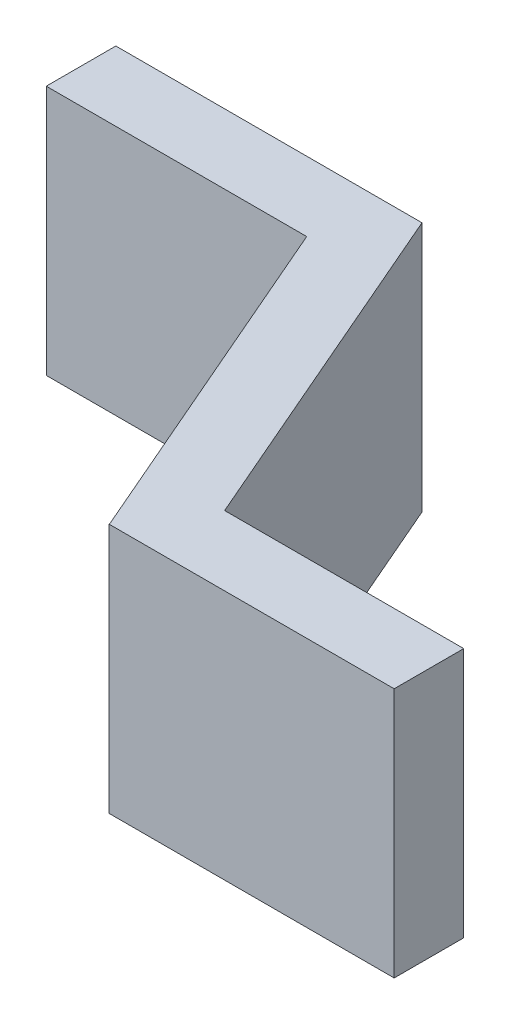
ISO-10303-21;
HEADER;
FILE_DESCRIPTION(('STEP AP214'),'2;1');
FILE_NAME('part.step','',(''),(''),'','','');
FILE_SCHEMA(('AUTOMOTIVE_DESIGN { 1 0 10303 214 1 1 1 1 }'));
ENDSEC;
DATA;
#1=APPLICATION_CONTEXT('core data for automotive mechanical design processes');
#2=APPLICATION_PROTOCOL_DEFINITION('international standard','automotive_design',2000,#1);
#3=PRODUCT_CONTEXT('',#1,'mechanical');
#4=PRODUCT('Part','Part','',(#3));
#5=PRODUCT_RELATED_PRODUCT_CATEGORY('part','',(#4));
#6=PRODUCT_DEFINITION_FORMATION('','',#4);
#7=PRODUCT_DEFINITION_CONTEXT('part definition',#1,'design');
#8=PRODUCT_DEFINITION('design','',#6,#7);
#9=PRODUCT_DEFINITION_SHAPE('','',#8);
#10=(LENGTH_UNIT() NAMED_UNIT(*) SI_UNIT(.MILLI.,.METRE.));
#11=(NAMED_UNIT(*) PLANE_ANGLE_UNIT() SI_UNIT($,.RADIAN.));
#12=(NAMED_UNIT(*) SI_UNIT($,.STERADIAN.) SOLID_ANGLE_UNIT());
#13=UNCERTAINTY_MEASURE_WITH_UNIT(LENGTH_MEASURE(1.E-05),#10,'distance_accuracy_value','');
#14=(GEOMETRIC_REPRESENTATION_CONTEXT(3) GLOBAL_UNCERTAINTY_ASSIGNED_CONTEXT((#13)) GLOBAL_UNIT_ASSIGNED_CONTEXT((#10,
#11,#12)) REPRESENTATION_CONTEXT('',''));
#15=CARTESIAN_POINT('',(0.,0.,0.));
#16=DIRECTION('',(0.,0.,1.));
#17=DIRECTION('',(1.,0.,0.));
#18=AXIS2_PLACEMENT_3D('',#15,#16,#17);
#19=CARTESIAN_POINT('',(0.,5.82,0.));
#20=DIRECTION('',(1.,0.,0.));
#21=DIRECTION('',(0.,0.,-1.));
#22=AXIS2_PLACEMENT_3D('',#19,#20,#21);
#23=PLANE('',#22);
#24=DIRECTION('',(0.,1.,0.));
#25=VECTOR('',#24,1.);
#26=CARTESIAN_POINT('',(0.,5.82,0.));
#27=LINE('',#26,#25);
#28=CARTESIAN_POINT('',(0.,6.180000014305,-1.30339419427667E-10));
#29=VERTEX_POINT('',#28);
#30=CARTESIAN_POINT('',(0.,5.82,-1.556831963824E-10));
#31=VERTEX_POINT('',#30);
#32=EDGE_CURVE('E123',#29,#31,#27,.F.);
#33=ORIENTED_EDGE('',*,*,#32,.T.);
#34=DIRECTION('',(0.,0.,1.));
#35=VECTOR('',#34,1.);
#36=CARTESIAN_POINT('',(0.,5.82,0.));
#37=LINE('',#36,#35);
#38=CARTESIAN_POINT('',(0.,5.82,0.10000000149));
#39=VERTEX_POINT('',#38);
#40=EDGE_CURVE('E115',#31,#39,#37,.T.);
#41=ORIENTED_EDGE('',*,*,#40,.T.);
#42=DIRECTION('',(0.,1.,0.));
#43=VECTOR('',#42,1.);
#44=CARTESIAN_POINT('',(0.,5.82,0.10000000149));
#45=LINE('',#44,#43);
#46=CARTESIAN_POINT('',(0.,6.180000014305,0.10000000149));
#47=VERTEX_POINT('',#46);
#48=EDGE_CURVE('E134',#47,#39,#45,.F.);
#49=ORIENTED_EDGE('',*,*,#48,.F.);
#50=DIRECTION('',(0.,0.,1.));
#51=VECTOR('',#50,1.);
#52=CARTESIAN_POINT('',(0.,6.180000014305,0.));
#53=LINE('',#52,#51);
#54=EDGE_CURVE('E140',#29,#47,#53,.T.);
#55=ORIENTED_EDGE('',*,*,#54,.F.);
#56=EDGE_LOOP('',(#33,#41,#49,#55));
#57=FACE_BOUND('',#56,.T.);
#58=ADVANCED_FACE('F17',(#57),#23,.F.);
#59=CARTESIAN_POINT('',(0.,5.82,0.10000000149));
#60=DIRECTION('',(0.,0.,1.));
#61=DIRECTION('',(1.,0.,0.));
#62=AXIS2_PLACEMENT_3D('',#59,#60,#61);
#63=PLANE('',#62);
#64=DIRECTION('',(0.,1.,0.));
#65=VECTOR('',#64,1.);
#66=CARTESIAN_POINT('',(0.374312226605181,5.82,0.100000001489922));
#67=LINE('',#66,#65);
#68=CARTESIAN_POINT('',(0.37431222660506,6.180000014305,0.100000001489974));
#69=VERTEX_POINT('',#68);
#70=CARTESIAN_POINT('',(0.374312226605091,5.82,0.100000001489974));
#71=VERTEX_POINT('',#70);
#72=EDGE_CURVE('E132',#69,#71,#67,.F.);
#73=ORIENTED_EDGE('',*,*,#72,.F.);
#74=DIRECTION('',(1.,0.,0.));
#75=VECTOR('',#74,1.);
#76=CARTESIAN_POINT('',(0.44,6.180000014305,0.10000000149));
#77=LINE('',#76,#75);
#78=EDGE_CURVE('E137',#47,#69,#77,.T.);
#79=ORIENTED_EDGE('',*,*,#78,.F.);
#80=ORIENTED_EDGE('',*,*,#48,.T.);
#81=DIRECTION('',(1.,0.,0.));
#82=VECTOR('',#81,1.);
#83=CARTESIAN_POINT('',(0.44,5.82,0.10000000149));
#84=LINE('',#83,#82);
#85=EDGE_CURVE('E111',#39,#71,#84,.T.);
#86=ORIENTED_EDGE('',*,*,#85,.T.);
#87=EDGE_LOOP('',(#73,#79,#80,#86));
#88=FACE_BOUND('',#87,.T.);
#89=ADVANCED_FACE('F214',(#88),#63,.T.);
#90=CARTESIAN_POINT('',(0.348224508223,5.82,0.03971472531736));
#91=DIRECTION('',(-0.917754904098641,0.,0.397147247255844));
#92=DIRECTION('',(0.397147247255844,0.,0.917754904098641));
#93=AXIS2_PLACEMENT_3D('',#90,#91,#92);
#94=PLANE('',#93);
#95=DIRECTION('',(0.397147247255413,0.,0.917754904098827));
#96=VECTOR('',#95,1.);
#97=CARTESIAN_POINT('',(0.374312226605,5.82,0.10000000149));
#98=LINE('',#97,#96);
#99=CARTESIAN_POINT('',(0.59,5.82,0.59842599627));
#100=VERTEX_POINT('',#99);
#101=EDGE_CURVE('E110',#71,#100,#98,.T.);
#102=ORIENTED_EDGE('',*,*,#101,.T.);
#103=DIRECTION('',(0.,1.,0.));
#104=VECTOR('',#103,1.);
#105=CARTESIAN_POINT('',(0.59,5.82,0.59842599627));
#106=LINE('',#105,#104);
#107=CARTESIAN_POINT('',(0.59,6.180000014305,0.59842599627));
#108=VERTEX_POINT('',#107);
#109=EDGE_CURVE('E86',#100,#108,#106,.T.);
#110=ORIENTED_EDGE('',*,*,#109,.T.);
#111=DIRECTION('',(0.397147247255413,0.,0.917754904098827));
#112=VECTOR('',#111,1.);
#113=CARTESIAN_POINT('',(0.374312226605,6.180000014305,0.10000000149));
#114=LINE('',#113,#112);
#115=EDGE_CURVE('E139',#69,#108,#114,.T.);
#116=ORIENTED_EDGE('',*,*,#115,.F.);
#117=ORIENTED_EDGE('',*,*,#72,.T.);
#118=EDGE_LOOP('',(#102,#110,#116,#117));
#119=FACE_BOUND('',#118,.T.);
#120=ADVANCED_FACE('F215',(#119),#94,.T.);
#121=CARTESIAN_POINT('',(0.59,5.82,0.5));
#122=DIRECTION('',(1.,0.,0.));
#123=DIRECTION('',(0.,0.,-1.));
#124=AXIS2_PLACEMENT_3D('',#121,#122,#123);
#125=PLANE('',#124);
#126=ORIENTED_EDGE('',*,*,#109,.F.);
#127=DIRECTION('',(0.,0.,-1.));
#128=VECTOR('',#127,1.);
#129=CARTESIAN_POINT('',(0.59,5.82,0.5));
#130=LINE('',#129,#128);
#131=CARTESIAN_POINT('',(0.59,5.82,0.60000000149));
#132=VERTEX_POINT('',#131);
#133=EDGE_CURVE('E20',#100,#132,#130,.F.);
#134=ORIENTED_EDGE('',*,*,#133,.T.);
#135=DIRECTION('',(0.,1.,0.));
#136=VECTOR('',#135,1.);
#137=CARTESIAN_POINT('',(0.59,5.82,0.60000000149));
#138=LINE('',#137,#136);
#139=CARTESIAN_POINT('',(0.59,6.180000014305,0.60000000149));
#140=VERTEX_POINT('',#139);
#141=EDGE_CURVE('E93',#140,#132,#138,.F.);
#142=ORIENTED_EDGE('',*,*,#141,.F.);
#143=DIRECTION('',(0.,0.,1.));
#144=VECTOR('',#143,1.);
#145=CARTESIAN_POINT('',(0.59,6.180000014305,0.));
#146=LINE('',#145,#144);
#147=EDGE_CURVE('E182',#108,#140,#146,.T.);
#148=ORIENTED_EDGE('',*,*,#147,.F.);
#149=EDGE_LOOP('',(#126,#134,#142,#148));
#150=FACE_BOUND('',#149,.T.);
#151=ADVANCED_FACE('F109',(#150),#125,.F.);
#152=CARTESIAN_POINT('',(0.59,5.82,0.60000000149));
#153=DIRECTION('',(0.,0.,1.));
#154=DIRECTION('',(1.,0.,0.));
#155=AXIS2_PLACEMENT_3D('',#152,#153,#154);
#156=PLANE('',#155);
#157=ORIENTED_EDGE('',*,*,#141,.T.);
#158=DIRECTION('',(1.,0.,0.));
#159=VECTOR('',#158,1.);
#160=CARTESIAN_POINT('',(0.44,5.82,0.60000000149));
#161=LINE('',#160,#159);
#162=CARTESIAN_POINT('',(0.999999996424,5.82,0.60000000149));
#163=VERTEX_POINT('',#162);
#164=EDGE_CURVE('E97',#132,#163,#161,.T.);
#165=ORIENTED_EDGE('',*,*,#164,.T.);
#166=DIRECTION('',(0.,1.,0.));
#167=VECTOR('',#166,1.);
#168=CARTESIAN_POINT('',(0.999999996424,5.82,0.60000000149));
#169=LINE('',#168,#167);
#170=CARTESIAN_POINT('',(0.999999996424,6.180000014305,0.60000000149));
#171=VERTEX_POINT('',#170);
#172=EDGE_CURVE('E99',#171,#163,#169,.F.);
#173=ORIENTED_EDGE('',*,*,#172,.F.);
#174=DIRECTION('',(1.,0.,0.));
#175=VECTOR('',#174,1.);
#176=CARTESIAN_POINT('',(0.44,6.180000014305,0.60000000149));
#177=LINE('',#176,#175);
#178=EDGE_CURVE('E98',#140,#171,#177,.T.);
#179=ORIENTED_EDGE('',*,*,#178,.F.);
#180=EDGE_LOOP('',(#157,#165,#173,#179));
#181=FACE_BOUND('',#180,.T.);
#182=ADVANCED_FACE('F95',(#181),#156,.T.);
#183=CARTESIAN_POINT('',(0.999999996424,5.82,0.5));
#184=DIRECTION('',(1.,0.,0.));
#185=DIRECTION('',(0.,0.,-1.));
#186=AXIS2_PLACEMENT_3D('',#183,#184,#185);
#187=PLANE('',#186);
#188=DIRECTION('',(0.,0.,1.));
#189=VECTOR('',#188,1.);
#190=CARTESIAN_POINT('',(0.999999996424,5.82,0.));
#191=LINE('',#190,#189);
#192=CARTESIAN_POINT('',(0.999999996424,5.82,0.5));
#193=VERTEX_POINT('',#192);
#194=EDGE_CURVE('E107',#163,#193,#191,.F.);
#195=ORIENTED_EDGE('',*,*,#194,.T.);
#196=DIRECTION('',(0.,1.,0.));
#197=VECTOR('',#196,1.);
#198=CARTESIAN_POINT('',(0.999999996424,5.82,0.5));
#199=LINE('',#198,#197);
#200=CARTESIAN_POINT('',(0.999999996424,6.180000014305,0.5));
#201=VERTEX_POINT('',#200);
#202=EDGE_CURVE('E192',#193,#201,#199,.T.);
#203=ORIENTED_EDGE('',*,*,#202,.T.);
#204=DIRECTION('',(0.,0.,1.));
#205=VECTOR('',#204,1.);
#206=CARTESIAN_POINT('',(0.999999996424,6.180000014305,0.));
#207=LINE('',#206,#205);
#208=EDGE_CURVE('E126',#171,#201,#207,.F.);
#209=ORIENTED_EDGE('',*,*,#208,.F.);
#210=ORIENTED_EDGE('',*,*,#172,.T.);
#211=EDGE_LOOP('',(#195,#203,#209,#210));
#212=FACE_BOUND('',#211,.T.);
#213=ADVANCED_FACE('F238',(#212),#187,.T.);
#214=CARTESIAN_POINT('',(0.,5.82,0.));
#215=DIRECTION('',(0.,0.,1.));
#216=DIRECTION('',(1.,0.,0.));
#217=AXIS2_PLACEMENT_3D('',#214,#215,#216);
#218=PLANE('',#217);
#219=DIRECTION('',(1.,0.,0.));
#220=VECTOR('',#219,1.);
#221=CARTESIAN_POINT('',(0.44,5.82,-2.335247945736E-10));
#222=LINE('',#221,#220);
#223=CARTESIAN_POINT('',(0.439999999656335,5.82,-3.43069646239979E-10));
#224=VERTEX_POINT('',#223);
#225=EDGE_CURVE('E155',#224,#31,#222,.F.);
#226=ORIENTED_EDGE('',*,*,#225,.T.);
#227=ORIENTED_EDGE('',*,*,#32,.F.);
#228=DIRECTION('',(1.,0.,0.));
#229=VECTOR('',#228,1.);
#230=CARTESIAN_POINT('',(0.44,6.180000014305,-1.955091291415E-10));
#231=LINE('',#230,#229);
#232=CARTESIAN_POINT('',(0.439999999458534,6.180000014305,-1.955091291415E-10));
#233=VERTEX_POINT('',#232);
#234=EDGE_CURVE('E147',#233,#29,#231,.F.);
#235=ORIENTED_EDGE('',*,*,#234,.F.);
#236=DIRECTION('',(0.,1.,0.));
#237=VECTOR('',#236,1.);
#238=CARTESIAN_POINT('',(0.439999999804137,5.82,-4.52614497906357E-10));
#239=LINE('',#238,#237);
#240=EDGE_CURVE('E128',#233,#224,#239,.F.);
#241=ORIENTED_EDGE('',*,*,#240,.T.);
#242=EDGE_LOOP('',(#226,#227,#235,#241));
#243=FACE_BOUND('',#242,.T.);
#244=ADVANCED_FACE('F235',(#243),#218,.F.);
#245=CARTESIAN_POINT('',(0.44,5.82,0.));
#246=DIRECTION('',(0.,1.,0.));
#247=DIRECTION('',(0.,0.,1.));
#248=AXIS2_PLACEMENT_3D('',#245,#246,#247);
#249=PLANE('',#248);
#250=DIRECTION('',(1.,0.,0.));
#251=VECTOR('',#250,1.);
#252=CARTESIAN_POINT('',(0.59,5.82,0.5));
#253=LINE('',#252,#251);
#254=CARTESIAN_POINT('',(0.656368904967001,5.82,0.499999999999999));
#255=VERTEX_POINT('',#254);
#256=EDGE_CURVE('E166',#255,#193,#253,.T.);
#257=ORIENTED_EDGE('',*,*,#256,.T.);
#258=ORIENTED_EDGE('',*,*,#194,.F.);
#259=ORIENTED_EDGE('',*,*,#164,.F.);
#260=ORIENTED_EDGE('',*,*,#133,.F.);
#261=ORIENTED_EDGE('',*,*,#101,.F.);
#262=ORIENTED_EDGE('',*,*,#85,.F.);
#263=ORIENTED_EDGE('',*,*,#40,.F.);
#264=ORIENTED_EDGE('',*,*,#225,.F.);
#265=DIRECTION('',(0.397147247255844,0.,0.917754904098641));
#266=VECTOR('',#265,1.);
#267=CARTESIAN_POINT('',(0.44,5.82,0.));
#268=LINE('',#267,#266);
#269=EDGE_CURVE('E160',#224,#255,#268,.T.);
#270=ORIENTED_EDGE('',*,*,#269,.T.);
#271=EDGE_LOOP('',(#257,#258,#259,#260,#261,#262,#263,#264,#270));
#272=FACE_BOUND('',#271,.T.);
#273=ADVANCED_FACE('F104',(#272),#249,.F.);
#274=CARTESIAN_POINT('',(0.59,5.82,0.5));
#275=DIRECTION('',(0.,0.,1.));
#276=DIRECTION('',(1.,0.,0.));
#277=AXIS2_PLACEMENT_3D('',#274,#275,#276);
#278=PLANE('',#277);
#279=ORIENTED_EDGE('',*,*,#256,.F.);
#280=DIRECTION('',(0.,1.,0.));
#281=VECTOR('',#280,1.);
#282=CARTESIAN_POINT('',(0.656368904967005,5.82,0.499999999999998));
#283=LINE('',#282,#281);
#284=CARTESIAN_POINT('',(0.656368904967001,6.180000014305,0.499999999999999));
#285=VERTEX_POINT('',#284);
#286=EDGE_CURVE('E26',#255,#285,#283,.T.);
#287=ORIENTED_EDGE('',*,*,#286,.T.);
#288=DIRECTION('',(1.,0.,0.));
#289=VECTOR('',#288,1.);
#290=CARTESIAN_POINT('',(0.44,6.180000014305,0.5));
#291=LINE('',#290,#289);
#292=EDGE_CURVE('E34',#201,#285,#291,.F.);
#293=ORIENTED_EDGE('',*,*,#292,.F.);
#294=ORIENTED_EDGE('',*,*,#202,.F.);
#295=EDGE_LOOP('',(#279,#287,#293,#294));
#296=FACE_BOUND('',#295,.T.);
#297=ADVANCED_FACE('F199',(#296),#278,.F.);
#298=CARTESIAN_POINT('',(0.44,6.180000014305,0.));
#299=DIRECTION('',(0.,1.,0.));
#300=DIRECTION('',(0.,0.,1.));
#301=AXIS2_PLACEMENT_3D('',#298,#299,#300);
#302=PLANE('',#301);
#303=ORIENTED_EDGE('',*,*,#178,.T.);
#304=ORIENTED_EDGE('',*,*,#208,.T.);
#305=ORIENTED_EDGE('',*,*,#292,.T.);
#306=DIRECTION('',(0.397147247255844,0.,0.917754904098641));
#307=VECTOR('',#306,1.);
#308=CARTESIAN_POINT('',(0.44,6.180000014305,0.));
#309=LINE('',#308,#307);
#310=EDGE_CURVE('E11',#285,#233,#309,.F.);
#311=ORIENTED_EDGE('',*,*,#310,.T.);
#312=ORIENTED_EDGE('',*,*,#234,.T.);
#313=ORIENTED_EDGE('',*,*,#54,.T.);
#314=ORIENTED_EDGE('',*,*,#78,.T.);
#315=ORIENTED_EDGE('',*,*,#115,.T.);
#316=ORIENTED_EDGE('',*,*,#147,.T.);
#317=EDGE_LOOP('',(#303,#304,#305,#311,#312,#313,#314,#315,#316));
#318=FACE_BOUND('',#317,.T.);
#319=ADVANCED_FACE('F204',(#318),#302,.T.);
#320=CARTESIAN_POINT('',(0.44,5.82,0.));
#321=DIRECTION('',(-0.917754904098641,0.,0.397147247255844));
#322=DIRECTION('',(0.397147247255844,0.,0.917754904098641));
#323=AXIS2_PLACEMENT_3D('',#320,#321,#322);
#324=PLANE('',#323);
#325=ORIENTED_EDGE('',*,*,#286,.F.);
#326=ORIENTED_EDGE('',*,*,#269,.F.);
#327=ORIENTED_EDGE('',*,*,#240,.F.);
#328=ORIENTED_EDGE('',*,*,#310,.F.);
#329=EDGE_LOOP('',(#325,#326,#327,#328));
#330=FACE_BOUND('',#329,.T.);
#331=ADVANCED_FACE('F201',(#330),#324,.F.);
#332=CLOSED_SHELL('',(#58,#89,#120,#151,#182,#213,#244,#273,#297,#319,#331));
#333=MANIFOLD_SOLID_BREP('B1',#332);
#334=ADVANCED_BREP_SHAPE_REPRESENTATION('',(#18,#333),#14);
#335=SHAPE_DEFINITION_REPRESENTATION(#9,#334);
ENDSEC;
END-ISO-10303-21;
